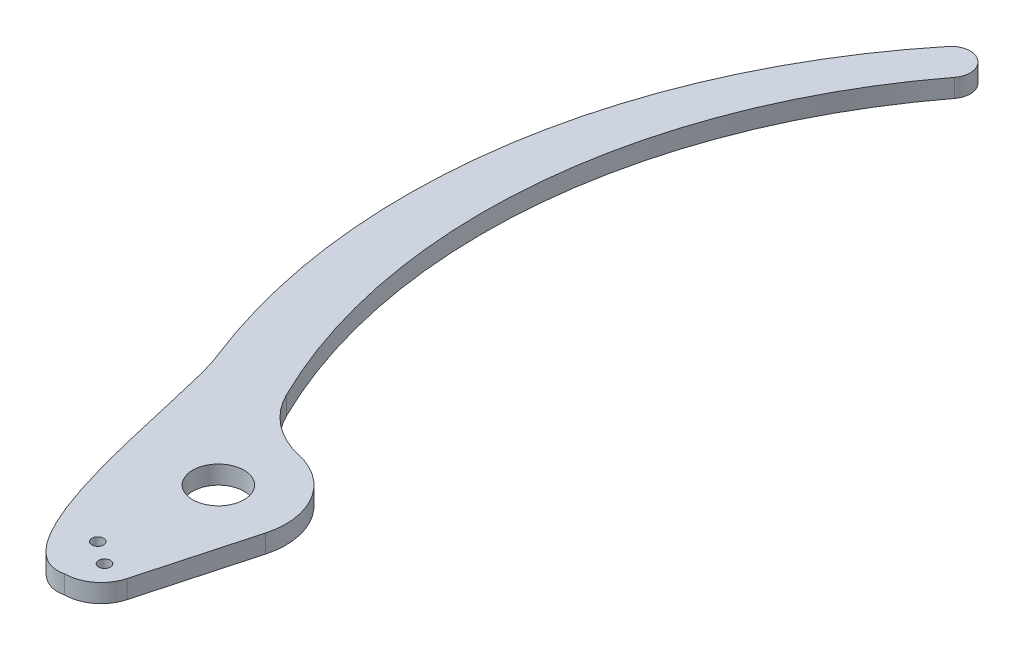
ISO-10303-21;
HEADER;
FILE_DESCRIPTION(('STEP AP214'),'2;1');
FILE_NAME('part.step','',(''),(''),'','','');
FILE_SCHEMA(('AUTOMOTIVE_DESIGN { 1 0 10303 214 1 1 1 1 }'));
ENDSEC;
DATA;
#1=APPLICATION_CONTEXT('core data for automotive mechanical design processes');
#2=APPLICATION_PROTOCOL_DEFINITION('international standard','automotive_design',2000,#1);
#3=PRODUCT_CONTEXT('',#1,'mechanical');
#4=PRODUCT('Part','Part','',(#3));
#5=PRODUCT_RELATED_PRODUCT_CATEGORY('part','',(#4));
#6=PRODUCT_DEFINITION_FORMATION('','',#4);
#7=PRODUCT_DEFINITION_CONTEXT('part definition',#1,'design');
#8=PRODUCT_DEFINITION('design','',#6,#7);
#9=PRODUCT_DEFINITION_SHAPE('','',#8);
#10=(LENGTH_UNIT() NAMED_UNIT(*) SI_UNIT(.MILLI.,.METRE.));
#11=(NAMED_UNIT(*) PLANE_ANGLE_UNIT() SI_UNIT($,.RADIAN.));
#12=(NAMED_UNIT(*) SI_UNIT($,.STERADIAN.) SOLID_ANGLE_UNIT());
#13=UNCERTAINTY_MEASURE_WITH_UNIT(LENGTH_MEASURE(1.E-05),#10,'distance_accuracy_value','');
#14=(GEOMETRIC_REPRESENTATION_CONTEXT(3) GLOBAL_UNCERTAINTY_ASSIGNED_CONTEXT((#13)) GLOBAL_UNIT_ASSIGNED_CONTEXT((#10,
#11,#12)) REPRESENTATION_CONTEXT('',''));
#15=CARTESIAN_POINT('',(0.,0.,0.));
#16=DIRECTION('',(0.,0.,1.));
#17=DIRECTION('',(1.,0.,0.));
#18=AXIS2_PLACEMENT_3D('',#15,#16,#17);
#19=CARTESIAN_POINT('',(0.,0.,26.67));
#20=CARTESIAN_POINT('',(-11.2453526482348,0.,29.3828785636841));
#21=CARTESIAN_POINT('',(-15.9815189528567,0.,-11.110422607672));
#22=CARTESIAN_POINT('',(-19.5341933980515,0.,-19.4117226985687));
#23=B_SPLINE_CURVE_WITH_KNOTS('',3,(#19,#20,#21,#22),.UNSPECIFIED.,.F.,.F.,(4,4),(0.,1.),.UNSPECIFIED.);
#24=DIRECTION('',(0.,-1.,0.));
#25=VECTOR('',#24,1.);
#26=SURFACE_OF_LINEAR_EXTRUSION('',#23,#25);
#27=CARTESIAN_POINT('',(0.,-3.175,26.67));
#28=CARTESIAN_POINT('',(-11.2453526482348,-3.175,29.3828785636841));
#29=CARTESIAN_POINT('',(-15.9815189528567,-3.175,-11.110422607672));
#30=CARTESIAN_POINT('',(-19.5341933980515,-3.175,-19.4117226985687));
#31=B_SPLINE_CURVE_WITH_KNOTS('',3,(#27,#28,#29,#30),.UNSPECIFIED.,.F.,.F.,(4,4),(0.,1.),.UNSPECIFIED.);
#32=CARTESIAN_POINT('',(0.,-3.175,26.67));
#33=VERTEX_POINT('',#32);
#34=CARTESIAN_POINT('',(-19.5341933980515,-3.175,-19.4117226985687));
#35=VERTEX_POINT('',#34);
#36=EDGE_CURVE('E133',#33,#35,#31,.T.);
#37=ORIENTED_EDGE('',*,*,#36,.F.);
#38=DIRECTION('',(0.,-1.,0.));
#39=VECTOR('',#38,1.);
#40=CARTESIAN_POINT('',(0.,0.,26.67));
#41=LINE('',#40,#39);
#42=CARTESIAN_POINT('',(0.,0.,26.67));
#43=VERTEX_POINT('',#42);
#44=EDGE_CURVE('E11',#43,#33,#41,.T.);
#45=ORIENTED_EDGE('',*,*,#44,.F.);
#46=CARTESIAN_POINT('',(-19.5341933980515,0.,-19.4117226985687));
#47=VERTEX_POINT('',#46);
#48=EDGE_CURVE('E159',#43,#47,#23,.T.);
#49=ORIENTED_EDGE('',*,*,#48,.T.);
#50=DIRECTION('',(0.,-1.,0.));
#51=VECTOR('',#50,1.);
#52=CARTESIAN_POINT('',(-19.5341933980515,0.,-19.4117226985687));
#53=LINE('',#52,#51);
#54=EDGE_CURVE('E39',#47,#35,#53,.T.);
#55=ORIENTED_EDGE('',*,*,#54,.T.);
#56=EDGE_LOOP('',(#37,#45,#49,#55));
#57=FACE_BOUND('',#56,.T.);
#58=ADVANCED_FACE('F35',(#57),#26,.T.);
#59=CARTESIAN_POINT('',(0.,0.,20.32));
#60=DIRECTION('',(0.,-1.,0.));
#61=DIRECTION('',(0.,0.,-1.));
#62=AXIS2_PLACEMENT_3D('',#59,#60,#61);
#63=CYLINDRICAL_SURFACE('',#62,6.35000000000001);
#64=CARTESIAN_POINT('',(0.,-3.175,20.32));
#65=DIRECTION('',(0.,-1.,0.));
#66=DIRECTION('',(0.,0.,-1.));
#67=AXIS2_PLACEMENT_3D('',#64,#65,#66);
#68=CIRCLE('',#67,6.35000000000001);
#69=CARTESIAN_POINT('',(6.12428205822073,-3.175,21.9979956112445));
#70=VERTEX_POINT('',#69);
#71=EDGE_CURVE('E157',#70,#33,#68,.T.);
#72=ORIENTED_EDGE('',*,*,#71,.F.);
#73=DIRECTION('',(0.,-1.,0.));
#74=VECTOR('',#73,1.);
#75=CARTESIAN_POINT('',(6.12428205822073,0.,21.9979956112445));
#76=LINE('',#75,#74);
#77=CARTESIAN_POINT('',(6.12428205822073,0.,21.9979956112445));
#78=VERTEX_POINT('',#77);
#79=EDGE_CURVE('E45',#78,#70,#76,.T.);
#80=ORIENTED_EDGE('',*,*,#79,.F.);
#81=CARTESIAN_POINT('',(0.,0.,20.32));
#82=DIRECTION('',(0.,-1.,0.));
#83=DIRECTION('',(0.,0.,-1.));
#84=AXIS2_PLACEMENT_3D('',#81,#82,#83);
#85=CIRCLE('',#84,6.35000000000001);
#86=EDGE_CURVE('E123',#78,#43,#85,.T.);
#87=ORIENTED_EDGE('',*,*,#86,.T.);
#88=ORIENTED_EDGE('',*,*,#44,.T.);
#89=EDGE_LOOP('',(#72,#80,#87,#88));
#90=FACE_BOUND('',#89,.T.);
#91=ADVANCED_FACE('F171',(#90),#63,.T.);
#92=CARTESIAN_POINT('',(11.303,0.,3.09691555901458));
#93=DIRECTION('',(0.96445386743633,0.,0.264251277361352));
#94=DIRECTION('',(0.264251277361352,0.,-0.96445386743633));
#95=AXIS2_PLACEMENT_3D('',#92,#93,#94);
#96=PLANE('',#95);
#97=DIRECTION('',(-0.264251277361352,0.,0.96445386743633));
#98=VECTOR('',#97,1.);
#99=CARTESIAN_POINT('',(11.303,-3.175,3.09691555901458));
#100=LINE('',#99,#98);
#101=CARTESIAN_POINT('',(11.303,-3.175,3.09691555901458));
#102=VERTEX_POINT('',#101);
#103=EDGE_CURVE('E110',#102,#70,#100,.T.);
#104=ORIENTED_EDGE('',*,*,#103,.F.);
#105=DIRECTION('',(0.,-1.,0.));
#106=VECTOR('',#105,1.);
#107=CARTESIAN_POINT('',(11.303,0.,3.09691555901458));
#108=LINE('',#107,#106);
#109=CARTESIAN_POINT('',(11.303,0.,3.09691555901458));
#110=VERTEX_POINT('',#109);
#111=EDGE_CURVE('E105',#110,#102,#108,.T.);
#112=ORIENTED_EDGE('',*,*,#111,.F.);
#113=DIRECTION('',(-0.264251277361352,0.,0.96445386743633));
#114=VECTOR('',#113,1.);
#115=CARTESIAN_POINT('',(11.303,0.,3.09691555901458));
#116=LINE('',#115,#114);
#117=EDGE_CURVE('E108',#110,#78,#116,.T.);
#118=ORIENTED_EDGE('',*,*,#117,.T.);
#119=ORIENTED_EDGE('',*,*,#79,.T.);
#120=EDGE_LOOP('',(#104,#112,#118,#119));
#121=FACE_BOUND('',#120,.T.);
#122=ADVANCED_FACE('F107',(#121),#96,.T.);
#123=CARTESIAN_POINT('',(0.,0.,0.));
#124=DIRECTION('',(0.,-1.,0.));
#125=DIRECTION('',(0.,0.,-1.));
#126=AXIS2_PLACEMENT_3D('',#123,#124,#125);
#127=CYLINDRICAL_SURFACE('',#126,11.7195859559827);
#128=CARTESIAN_POINT('',(0.,-3.175,0.));
#129=DIRECTION('',(0.,-1.,0.));
#130=DIRECTION('',(0.,0.,-1.));
#131=AXIS2_PLACEMENT_3D('',#128,#129,#130);
#132=CIRCLE('',#131,11.7195859559827);
#133=CARTESIAN_POINT('',(2.54,-3.175,-11.4410268323987));
#134=VERTEX_POINT('',#133);
#135=EDGE_CURVE('E154',#134,#102,#132,.T.);
#136=ORIENTED_EDGE('',*,*,#135,.F.);
#137=DIRECTION('',(0.,-1.,0.));
#138=VECTOR('',#137,1.);
#139=CARTESIAN_POINT('',(2.54,0.,-11.4410268323987));
#140=LINE('',#139,#138);
#141=CARTESIAN_POINT('',(2.54,0.,-11.4410268323987));
#142=VERTEX_POINT('',#141);
#143=EDGE_CURVE('E115',#142,#134,#140,.T.);
#144=ORIENTED_EDGE('',*,*,#143,.F.);
#145=CARTESIAN_POINT('',(0.,0.,0.));
#146=DIRECTION('',(0.,-1.,0.));
#147=DIRECTION('',(0.,0.,-1.));
#148=AXIS2_PLACEMENT_3D('',#145,#146,#147);
#149=CIRCLE('',#148,11.7195859559827);
#150=EDGE_CURVE('E121',#142,#110,#149,.T.);
#151=ORIENTED_EDGE('',*,*,#150,.T.);
#152=ORIENTED_EDGE('',*,*,#111,.T.);
#153=EDGE_LOOP('',(#136,#144,#151,#152));
#154=FACE_BOUND('',#153,.T.);
#155=ADVANCED_FACE('F125',(#154),#127,.T.);
#156=CARTESIAN_POINT('',(5.77892540416324,0.,-26.030252209237));
#157=DIRECTION('',(0.,-1.,0.));
#158=DIRECTION('',(0.,0.,-1.));
#159=AXIS2_PLACEMENT_3D('',#156,#157,#158);
#160=CYLINDRICAL_SURFACE('',#159,14.9444349130343);
#161=CARTESIAN_POINT('',(5.77892540416324,-3.175,-26.030252209237));
#162=DIRECTION('',(0.,1.,0.));
#163=DIRECTION('',(0.,0.,1.));
#164=AXIS2_PLACEMENT_3D('',#161,#162,#163);
#165=CIRCLE('',#164,14.9444349130343);
#166=CARTESIAN_POINT('',(-7.62,-3.175,-19.4117226985688));
#167=VERTEX_POINT('',#166);
#168=EDGE_CURVE('E151',#167,#134,#165,.T.);
#169=ORIENTED_EDGE('',*,*,#168,.F.);
#170=DIRECTION('',(0.,-1.,0.));
#171=VECTOR('',#170,1.);
#172=CARTESIAN_POINT('',(-7.62,0.,-19.4117226985688));
#173=LINE('',#172,#171);
#174=CARTESIAN_POINT('',(-7.62,0.,-19.4117226985688));
#175=VERTEX_POINT('',#174);
#176=EDGE_CURVE('E163',#175,#167,#173,.T.);
#177=ORIENTED_EDGE('',*,*,#176,.F.);
#178=CARTESIAN_POINT('',(5.77892540416324,0.,-26.030252209237));
#179=DIRECTION('',(0.,1.,0.));
#180=DIRECTION('',(0.,0.,1.));
#181=AXIS2_PLACEMENT_3D('',#178,#179,#180);
#182=CIRCLE('',#181,14.9444349130343);
#183=EDGE_CURVE('E126',#175,#142,#182,.T.);
#184=ORIENTED_EDGE('',*,*,#183,.T.);
#185=ORIENTED_EDGE('',*,*,#143,.T.);
#186=EDGE_LOOP('',(#169,#177,#184,#185));
#187=FACE_BOUND('',#186,.T.);
#188=ADVANCED_FACE('F184',(#187),#160,.F.);
#189=CARTESIAN_POINT('',(82.55,0.,-63.9520711202062));
#190=DIRECTION('',(0.,-1.,0.));
#191=DIRECTION('',(0.,0.,-1.));
#192=AXIS2_PLACEMENT_3D('',#189,#190,#191);
#193=CYLINDRICAL_SURFACE('',#192,100.570729029479);
#194=CARTESIAN_POINT('',(82.55,-3.175,-63.9520711202062));
#195=DIRECTION('',(0.,1.,0.));
#196=DIRECTION('',(0.,0.,1.));
#197=AXIS2_PLACEMENT_3D('',#194,#195,#196);
#198=CIRCLE('',#197,100.570729029479);
#199=CARTESIAN_POINT('',(2.6241738572464,-3.175,-124.995775569717));
#200=VERTEX_POINT('',#199);
#201=EDGE_CURVE('E148',#200,#167,#198,.T.);
#202=ORIENTED_EDGE('',*,*,#201,.F.);
#203=DIRECTION('',(0.,-1.,0.));
#204=VECTOR('',#203,1.);
#205=CARTESIAN_POINT('',(2.6241738572464,0.,-124.995775569717));
#206=LINE('',#205,#204);
#207=CARTESIAN_POINT('',(2.6241738572464,0.,-124.995775569717));
#208=VERTEX_POINT('',#207);
#209=EDGE_CURVE('E165',#208,#200,#206,.T.);
#210=ORIENTED_EDGE('',*,*,#209,.F.);
#211=CARTESIAN_POINT('',(82.55,0.,-63.9520711202062));
#212=DIRECTION('',(0.,1.,0.));
#213=DIRECTION('',(0.,0.,1.));
#214=AXIS2_PLACEMENT_3D('',#211,#212,#213);
#215=CIRCLE('',#214,100.570729029479);
#216=EDGE_CURVE('E128',#208,#175,#215,.T.);
#217=ORIENTED_EDGE('',*,*,#216,.T.);
#218=ORIENTED_EDGE('',*,*,#176,.T.);
#219=EDGE_LOOP('',(#202,#210,#217,#218));
#220=FACE_BOUND('',#219,.T.);
#221=ADVANCED_FACE('F187',(#220),#193,.F.);
#222=CARTESIAN_POINT('',(0.,0.,-127.));
#223=DIRECTION('',(0.,-1.,0.));
#224=DIRECTION('',(0.,0.,-1.));
#225=AXIS2_PLACEMENT_3D('',#222,#223,#224);
#226=CYLINDRICAL_SURFACE('',#225,3.30200000000004);
#227=CARTESIAN_POINT('',(0.,-3.175,-127.));
#228=DIRECTION('',(0.,-1.,0.));
#229=DIRECTION('',(0.,0.,-1.));
#230=AXIS2_PLACEMENT_3D('',#227,#228,#229);
#231=CIRCLE('',#230,3.30200000000004);
#232=CARTESIAN_POINT('',(-2.5602148404256,-3.175,-129.085306685086));
#233=VERTEX_POINT('',#232);
#234=EDGE_CURVE('E145',#233,#200,#231,.T.);
#235=ORIENTED_EDGE('',*,*,#234,.F.);
#236=DIRECTION('',(0.,-1.,0.));
#237=VECTOR('',#236,1.);
#238=CARTESIAN_POINT('',(-2.5602148404256,0.,-129.085306685086));
#239=LINE('',#238,#237);
#240=CARTESIAN_POINT('',(-2.5602148404256,0.,-129.085306685086));
#241=VERTEX_POINT('',#240);
#242=EDGE_CURVE('E166',#241,#233,#239,.T.);
#243=ORIENTED_EDGE('',*,*,#242,.F.);
#244=CARTESIAN_POINT('',(0.,0.,-127.));
#245=DIRECTION('',(0.,-1.,0.));
#246=DIRECTION('',(0.,0.,-1.));
#247=AXIS2_PLACEMENT_3D('',#244,#245,#246);
#248=CIRCLE('',#247,3.30200000000004);
#249=EDGE_CURVE('E248',#241,#208,#248,.T.);
#250=ORIENTED_EDGE('',*,*,#249,.T.);
#251=ORIENTED_EDGE('',*,*,#209,.T.);
#252=EDGE_LOOP('',(#235,#243,#250,#251));
#253=FACE_BOUND('',#252,.T.);
#254=ADVANCED_FACE('F191',(#253),#226,.T.);
#255=CARTESIAN_POINT('',(82.55,0.,-59.7626478310436));
#256=DIRECTION('',(0.,-1.,0.));
#257=DIRECTION('',(0.,0.,-1.));
#258=AXIS2_PLACEMENT_3D('',#255,#256,#257);
#259=CYLINDRICAL_SURFACE('',#258,109.769666578602);
#260=CARTESIAN_POINT('',(82.55,-3.175,-59.7626478310436));
#261=DIRECTION('',(0.,-1.,0.));
#262=DIRECTION('',(0.,0.,-1.));
#263=AXIS2_PLACEMENT_3D('',#260,#261,#262);
#264=CIRCLE('',#263,109.769666578602);
#265=EDGE_CURVE('E138',#35,#233,#264,.T.);
#266=ORIENTED_EDGE('',*,*,#265,.F.);
#267=ORIENTED_EDGE('',*,*,#54,.F.);
#268=CARTESIAN_POINT('',(82.55,0.,-59.7626478310436));
#269=DIRECTION('',(0.,-1.,0.));
#270=DIRECTION('',(0.,0.,-1.));
#271=AXIS2_PLACEMENT_3D('',#268,#269,#270);
#272=CIRCLE('',#271,109.769666578602);
#273=EDGE_CURVE('E243',#47,#241,#272,.T.);
#274=ORIENTED_EDGE('',*,*,#273,.T.);
#275=ORIENTED_EDGE('',*,*,#242,.T.);
#276=EDGE_LOOP('',(#266,#267,#274,#275));
#277=FACE_BOUND('',#276,.T.);
#278=ADVANCED_FACE('F168',(#277),#259,.T.);
#279=CARTESIAN_POINT('',(-12.6518510251658,0.,7.75945564618343));
#280=DIRECTION('',(0.,1.,0.));
#281=DIRECTION('',(0.,0.,1.));
#282=AXIS2_PLACEMENT_3D('',#279,#280,#281);
#283=PLANE('',#282);
#284=CARTESIAN_POINT('',(1.95060580546316,0.,21.685828889061));
#285=DIRECTION('',(0.,-1.,0.));
#286=DIRECTION('',(0.,0.,1.));
#287=AXIS2_PLACEMENT_3D('',#284,#285,#286);
#288=CIRCLE('',#287,1.016);
#289=CARTESIAN_POINT('',(1.95060580546316,0.,22.701828889061));
#290=VERTEX_POINT('',#289);
#291=EDGE_CURVE('E222',#290,#290,#288,.T.);
#292=ORIENTED_EDGE('',*,*,#291,.T.);
#293=EDGE_LOOP('',(#292));
#294=FACE_BOUND('',#293,.T.);
#295=CARTESIAN_POINT('',(-1.95060580546317,0.,18.9541711109391));
#296=DIRECTION('',(0.,-1.,0.));
#297=DIRECTION('',(0.,0.,1.));
#298=AXIS2_PLACEMENT_3D('',#295,#296,#297);
#299=CIRCLE('',#298,1.016);
#300=CARTESIAN_POINT('',(-1.95060580546317,0.,19.9701711109391));
#301=VERTEX_POINT('',#300);
#302=EDGE_CURVE('E230',#301,#301,#299,.T.);
#303=ORIENTED_EDGE('',*,*,#302,.T.);
#304=EDGE_LOOP('',(#303));
#305=FACE_BOUND('',#304,.T.);
#306=CARTESIAN_POINT('',(0.,0.,0.));
#307=DIRECTION('',(0.,-1.,0.));
#308=DIRECTION('',(0.,0.,1.));
#309=AXIS2_PLACEMENT_3D('',#306,#307,#308);
#310=CIRCLE('',#309,4.445);
#311=CARTESIAN_POINT('',(0.,0.,4.445));
#312=VERTEX_POINT('',#311);
#313=EDGE_CURVE('E139',#312,#312,#310,.T.);
#314=ORIENTED_EDGE('',*,*,#313,.T.);
#315=EDGE_LOOP('',(#314));
#316=FACE_BOUND('',#315,.T.);
#317=ORIENTED_EDGE('',*,*,#48,.F.);
#318=ORIENTED_EDGE('',*,*,#86,.F.);
#319=ORIENTED_EDGE('',*,*,#117,.F.);
#320=ORIENTED_EDGE('',*,*,#150,.F.);
#321=ORIENTED_EDGE('',*,*,#183,.F.);
#322=ORIENTED_EDGE('',*,*,#216,.F.);
#323=ORIENTED_EDGE('',*,*,#249,.F.);
#324=ORIENTED_EDGE('',*,*,#273,.F.);
#325=EDGE_LOOP('',(#317,#318,#319,#320,#321,#322,#323,#324));
#326=FACE_BOUND('',#325,.T.);
#327=ADVANCED_FACE('F119',(#294,#305,#316,#326),#283,.T.);
#328=CARTESIAN_POINT('',(-12.6518510251658,-3.175,7.75945564618343));
#329=DIRECTION('',(0.,1.,0.));
#330=DIRECTION('',(0.,0.,1.));
#331=AXIS2_PLACEMENT_3D('',#328,#329,#330);
#332=PLANE('',#331);
#333=CARTESIAN_POINT('',(1.95060580546316,-3.175,21.685828889061));
#334=DIRECTION('',(0.,-1.,0.));
#335=DIRECTION('',(0.,0.,1.));
#336=AXIS2_PLACEMENT_3D('',#333,#334,#335);
#337=CIRCLE('',#336,1.016);
#338=CARTESIAN_POINT('',(1.95060580546316,-3.175,22.701828889061));
#339=VERTEX_POINT('',#338);
#340=EDGE_CURVE('E225',#339,#339,#337,.T.);
#341=ORIENTED_EDGE('',*,*,#340,.F.);
#342=EDGE_LOOP('',(#341));
#343=FACE_BOUND('',#342,.T.);
#344=CARTESIAN_POINT('',(-1.95060580546317,-3.175,18.9541711109391));
#345=DIRECTION('',(0.,-1.,0.));
#346=DIRECTION('',(0.,0.,1.));
#347=AXIS2_PLACEMENT_3D('',#344,#345,#346);
#348=CIRCLE('',#347,1.016);
#349=CARTESIAN_POINT('',(-1.95060580546317,-3.175,19.9701711109391));
#350=VERTEX_POINT('',#349);
#351=EDGE_CURVE('E227',#350,#350,#348,.T.);
#352=ORIENTED_EDGE('',*,*,#351,.F.);
#353=EDGE_LOOP('',(#352));
#354=FACE_BOUND('',#353,.T.);
#355=CARTESIAN_POINT('',(0.,-3.175,0.));
#356=DIRECTION('',(0.,-1.,0.));
#357=DIRECTION('',(0.,0.,1.));
#358=AXIS2_PLACEMENT_3D('',#355,#356,#357);
#359=CIRCLE('',#358,4.445);
#360=CARTESIAN_POINT('',(0.,-3.175,4.445));
#361=VERTEX_POINT('',#360);
#362=EDGE_CURVE('E233',#361,#361,#359,.T.);
#363=ORIENTED_EDGE('',*,*,#362,.F.);
#364=EDGE_LOOP('',(#363));
#365=FACE_BOUND('',#364,.T.);
#366=ORIENTED_EDGE('',*,*,#36,.T.);
#367=ORIENTED_EDGE('',*,*,#265,.T.);
#368=ORIENTED_EDGE('',*,*,#234,.T.);
#369=ORIENTED_EDGE('',*,*,#201,.T.);
#370=ORIENTED_EDGE('',*,*,#168,.T.);
#371=ORIENTED_EDGE('',*,*,#135,.T.);
#372=ORIENTED_EDGE('',*,*,#103,.T.);
#373=ORIENTED_EDGE('',*,*,#71,.T.);
#374=EDGE_LOOP('',(#366,#367,#368,#369,#370,#371,#372,#373));
#375=FACE_BOUND('',#374,.T.);
#376=ADVANCED_FACE('F170',(#343,#354,#365,#375),#332,.F.);
#377=CARTESIAN_POINT('',(0.,0.,0.));
#378=DIRECTION('',(0.,-1.,0.));
#379=DIRECTION('',(0.,0.,-1.));
#380=AXIS2_PLACEMENT_3D('',#377,#378,#379);
#381=CYLINDRICAL_SURFACE('',#380,4.445);
#382=ORIENTED_EDGE('',*,*,#313,.F.);
#383=EDGE_LOOP('',(#382));
#384=FACE_BOUND('',#383,.T.);
#385=ORIENTED_EDGE('',*,*,#362,.T.);
#386=EDGE_LOOP('',(#385));
#387=FACE_BOUND('',#386,.T.);
#388=ADVANCED_FACE('F203',(#384,#387),#381,.F.);
#389=CARTESIAN_POINT('',(-1.95060580546317,0.,18.9541711109391));
#390=DIRECTION('',(0.,-1.,0.));
#391=DIRECTION('',(0.,0.,-1.));
#392=AXIS2_PLACEMENT_3D('',#389,#390,#391);
#393=CYLINDRICAL_SURFACE('',#392,1.016);
#394=ORIENTED_EDGE('',*,*,#302,.F.);
#395=EDGE_LOOP('',(#394));
#396=FACE_BOUND('',#395,.T.);
#397=ORIENTED_EDGE('',*,*,#351,.T.);
#398=EDGE_LOOP('',(#397));
#399=FACE_BOUND('',#398,.T.);
#400=ADVANCED_FACE('F210',(#396,#399),#393,.F.);
#401=CARTESIAN_POINT('',(1.95060580546316,0.,21.685828889061));
#402=DIRECTION('',(0.,-1.,0.));
#403=DIRECTION('',(0.,0.,-1.));
#404=AXIS2_PLACEMENT_3D('',#401,#402,#403);
#405=CYLINDRICAL_SURFACE('',#404,1.016);
#406=ORIENTED_EDGE('',*,*,#291,.F.);
#407=EDGE_LOOP('',(#406));
#408=FACE_BOUND('',#407,.T.);
#409=ORIENTED_EDGE('',*,*,#340,.T.);
#410=EDGE_LOOP('',(#409));
#411=FACE_BOUND('',#410,.T.);
#412=ADVANCED_FACE('F214',(#408,#411),#405,.F.);
#413=CLOSED_SHELL('',(#58,#91,#122,#155,#188,#221,#254,#278,#327,#376,#388,#400,#412));
#414=MANIFOLD_SOLID_BREP('B2',#413);
#415=ADVANCED_BREP_SHAPE_REPRESENTATION('',(#18,#414),#14);
#416=SHAPE_DEFINITION_REPRESENTATION(#9,#415);
ENDSEC;
END-ISO-10303-21;
